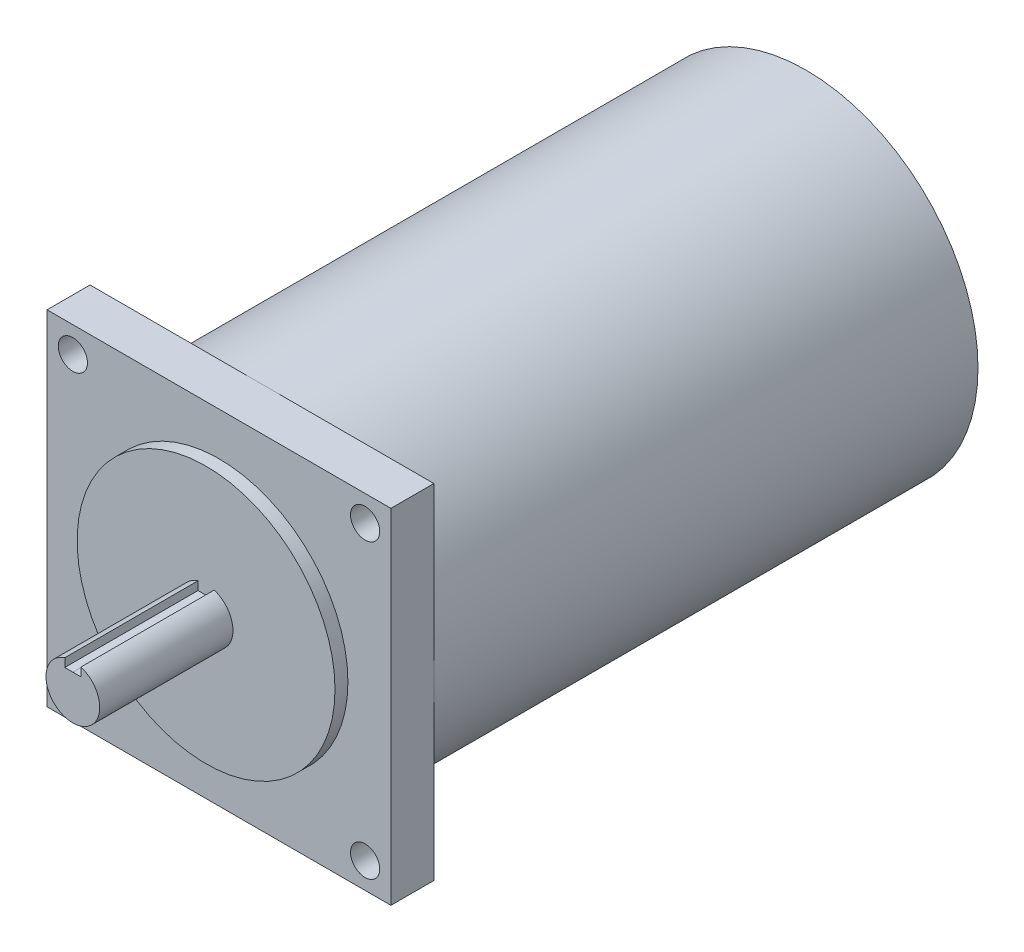
ISO-10303-21;
HEADER;
FILE_DESCRIPTION(('STEP AP214'),'2;1');
FILE_NAME('part.step','',(''),(''),'','','');
FILE_SCHEMA(('AUTOMOTIVE_DESIGN { 1 0 10303 214 1 1 1 1 }'));
ENDSEC;
DATA;
#1=APPLICATION_CONTEXT('core data for automotive mechanical design processes');
#2=APPLICATION_PROTOCOL_DEFINITION('international standard','automotive_design',2000,#1);
#3=PRODUCT_CONTEXT('',#1,'mechanical');
#4=PRODUCT('Part','Part','',(#3));
#5=PRODUCT_RELATED_PRODUCT_CATEGORY('part','',(#4));
#6=PRODUCT_DEFINITION_FORMATION('','',#4);
#7=PRODUCT_DEFINITION_CONTEXT('part definition',#1,'design');
#8=PRODUCT_DEFINITION('design','',#6,#7);
#9=PRODUCT_DEFINITION_SHAPE('','',#8);
#10=(LENGTH_UNIT() NAMED_UNIT(*) SI_UNIT(.MILLI.,.METRE.));
#11=(NAMED_UNIT(*) PLANE_ANGLE_UNIT() SI_UNIT($,.RADIAN.));
#12=(NAMED_UNIT(*) SI_UNIT($,.STERADIAN.) SOLID_ANGLE_UNIT());
#13=UNCERTAINTY_MEASURE_WITH_UNIT(LENGTH_MEASURE(1.E-05),#10,'distance_accuracy_value','');
#14=(GEOMETRIC_REPRESENTATION_CONTEXT(3) GLOBAL_UNCERTAINTY_ASSIGNED_CONTEXT((#13)) GLOBAL_UNIT_ASSIGNED_CONTEXT((#10,
#11,#12)) REPRESENTATION_CONTEXT('',''));
#15=CARTESIAN_POINT('',(0.,0.,0.));
#16=DIRECTION('',(0.,0.,1.));
#17=DIRECTION('',(1.,0.,0.));
#18=AXIS2_PLACEMENT_3D('',#15,#16,#17);
#19=CARTESIAN_POINT('',(0.,0.,0.));
#20=DIRECTION('',(0.,0.,1.));
#21=DIRECTION('',(1.,0.,0.));
#22=AXIS2_PLACEMENT_3D('',#19,#20,#21);
#23=PLANE('',#22);
#24=CARTESIAN_POINT('',(0.,0.,0.));
#25=DIRECTION('',(0.,0.,-1.));
#26=DIRECTION('',(-1.,0.,0.));
#27=AXIS2_PLACEMENT_3D('',#24,#25,#26);
#28=CIRCLE('',#27,50.8);
#29=CARTESIAN_POINT('',(-50.8,0.,0.));
#30=VERTEX_POINT('',#29);
#31=CARTESIAN_POINT('',(0.,50.8,0.));
#32=VERTEX_POINT('',#31);
#33=EDGE_CURVE('E155',#30,#32,#28,.T.);
#34=ORIENTED_EDGE('',*,*,#33,.F.);
#35=DIRECTION('',(0.,-1.,0.));
#36=VECTOR('',#35,1.);
#37=CARTESIAN_POINT('',(-50.8,50.8,0.));
#38=LINE('',#37,#36);
#39=CARTESIAN_POINT('',(-50.8,50.8,0.));
#40=VERTEX_POINT('',#39);
#41=EDGE_CURVE('E137',#40,#30,#38,.T.);
#42=ORIENTED_EDGE('',*,*,#41,.F.);
#43=DIRECTION('',(-1.,0.,0.));
#44=VECTOR('',#43,1.);
#45=CARTESIAN_POINT('',(-50.8,50.8,0.));
#46=LINE('',#45,#44);
#47=EDGE_CURVE('E157',#32,#40,#46,.T.);
#48=ORIENTED_EDGE('',*,*,#47,.F.);
#49=EDGE_LOOP('',(#34,#42,#48));
#50=FACE_BOUND('',#49,.T.);
#51=CARTESIAN_POINT('',(-43.18,43.18,0.));
#52=DIRECTION('',(0.,0.,1.));
#53=DIRECTION('',(1.,0.,0.));
#54=AXIS2_PLACEMENT_3D('',#51,#52,#53);
#55=CIRCLE('',#54,4.318);
#56=CARTESIAN_POINT('',(-38.862,43.18,0.));
#57=VERTEX_POINT('',#56);
#58=EDGE_CURVE('E210',#57,#57,#55,.T.);
#59=ORIENTED_EDGE('',*,*,#58,.T.);
#60=EDGE_LOOP('',(#59));
#61=FACE_BOUND('',#60,.T.);
#62=ADVANCED_FACE('F48',(#50,#61),#23,.F.);
#63=CARTESIAN_POINT('',(50.8,0.,0.));
#64=VERTEX_POINT('',#63);
#65=EDGE_CURVE('E65',#32,#64,#28,.T.);
#66=ORIENTED_EDGE('',*,*,#65,.F.);
#67=CARTESIAN_POINT('',(50.8,50.8,0.));
#68=VERTEX_POINT('',#67);
#69=EDGE_CURVE('E153',#68,#32,#46,.T.);
#70=ORIENTED_EDGE('',*,*,#69,.F.);
#71=DIRECTION('',(0.,1.,0.));
#72=VECTOR('',#71,1.);
#73=CARTESIAN_POINT('',(50.8,50.8,0.));
#74=LINE('',#73,#72);
#75=EDGE_CURVE('E234',#64,#68,#74,.T.);
#76=ORIENTED_EDGE('',*,*,#75,.F.);
#77=EDGE_LOOP('',(#66,#70,#76));
#78=FACE_BOUND('',#77,.T.);
#79=CARTESIAN_POINT('',(43.18,43.18,0.));
#80=DIRECTION('',(0.,0.,1.));
#81=DIRECTION('',(1.,0.,0.));
#82=AXIS2_PLACEMENT_3D('',#79,#80,#81);
#83=CIRCLE('',#82,4.318);
#84=CARTESIAN_POINT('',(47.498,43.18,0.));
#85=VERTEX_POINT('',#84);
#86=EDGE_CURVE('E216',#85,#85,#83,.T.);
#87=ORIENTED_EDGE('',*,*,#86,.T.);
#88=EDGE_LOOP('',(#87));
#89=FACE_BOUND('',#88,.T.);
#90=ADVANCED_FACE('F262',(#78,#89),#23,.F.);
#91=CARTESIAN_POINT('',(0.,-50.8,0.));
#92=VERTEX_POINT('',#91);
#93=EDGE_CURVE('E165',#64,#92,#28,.T.);
#94=ORIENTED_EDGE('',*,*,#93,.F.);
#95=CARTESIAN_POINT('',(50.8,-50.8,0.));
#96=VERTEX_POINT('',#95);
#97=EDGE_CURVE('E247',#96,#64,#74,.T.);
#98=ORIENTED_EDGE('',*,*,#97,.F.);
#99=DIRECTION('',(1.,0.,0.));
#100=VECTOR('',#99,1.);
#101=CARTESIAN_POINT('',(-50.8,-50.8,0.));
#102=LINE('',#101,#100);
#103=EDGE_CURVE('E147',#92,#96,#102,.T.);
#104=ORIENTED_EDGE('',*,*,#103,.F.);
#105=EDGE_LOOP('',(#94,#98,#104));
#106=FACE_BOUND('',#105,.T.);
#107=CARTESIAN_POINT('',(43.18,-43.18,0.));
#108=DIRECTION('',(0.,0.,1.));
#109=DIRECTION('',(1.,0.,0.));
#110=AXIS2_PLACEMENT_3D('',#107,#108,#109);
#111=CIRCLE('',#110,4.318);
#112=CARTESIAN_POINT('',(47.498,-43.18,0.));
#113=VERTEX_POINT('',#112);
#114=EDGE_CURVE('E222',#113,#113,#111,.T.);
#115=ORIENTED_EDGE('',*,*,#114,.T.);
#116=EDGE_LOOP('',(#115));
#117=FACE_BOUND('',#116,.T.);
#118=ADVANCED_FACE('F265',(#106,#117),#23,.F.);
#119=CARTESIAN_POINT('',(0.,0.,55.88));
#120=DIRECTION('',(0.,0.,-1.));
#121=DIRECTION('',(-1.,0.,0.));
#122=AXIS2_PLACEMENT_3D('',#119,#120,#121);
#123=CYLINDRICAL_SURFACE('',#122,7.9375);
#124=DIRECTION('',(0.,0.,-1.));
#125=VECTOR('',#124,1.);
#126=CARTESIAN_POINT('',(2.38760548199157,7.56989077281592,302.564684499768));
#127=LINE('',#126,#125);
#128=CARTESIAN_POINT('',(2.38760548199157,7.56989077281592,55.88));
#129=VERTEX_POINT('',#128);
#130=CARTESIAN_POINT('',(2.38760548199157,7.56989077281592,16.51));
#131=VERTEX_POINT('',#130);
#132=EDGE_CURVE('E198',#129,#131,#127,.T.);
#133=ORIENTED_EDGE('',*,*,#132,.F.);
#134=CARTESIAN_POINT('',(0.,0.,55.88));
#135=DIRECTION('',(0.,0.,1.));
#136=DIRECTION('',(1.,0.,0.));
#137=AXIS2_PLACEMENT_3D('',#134,#135,#136);
#138=CIRCLE('',#137,7.9375);
#139=CARTESIAN_POINT('',(-2.38759451800842,7.56989423093718,55.88));
#140=VERTEX_POINT('',#139);
#141=EDGE_CURVE('E180',#140,#129,#138,.T.);
#142=ORIENTED_EDGE('',*,*,#141,.F.);
#143=DIRECTION('',(0.,0.,-1.));
#144=VECTOR('',#143,1.);
#145=CARTESIAN_POINT('',(-2.38759451800842,7.56989423093718,302.564684499768));
#146=LINE('',#145,#144);
#147=CARTESIAN_POINT('',(-2.38759451800842,7.56989423093718,16.51));
#148=VERTEX_POINT('',#147);
#149=EDGE_CURVE('E189',#140,#148,#146,.T.);
#150=ORIENTED_EDGE('',*,*,#149,.T.);
#151=CARTESIAN_POINT('',(0.,0.,16.51));
#152=DIRECTION('',(0.,0.,1.));
#153=DIRECTION('',(1.,0.,0.));
#154=AXIS2_PLACEMENT_3D('',#151,#152,#153);
#155=CIRCLE('',#154,7.9375);
#156=EDGE_CURVE('E166',#148,#131,#155,.T.);
#157=ORIENTED_EDGE('',*,*,#156,.T.);
#158=EDGE_LOOP('',(#133,#142,#150,#157));
#159=FACE_BOUND('',#158,.T.);
#160=ADVANCED_FACE('F299',(#159),#123,.T.);
#161=CARTESIAN_POINT('',(0.,0.,55.88));
#162=DIRECTION('',(0.,0.,1.));
#163=DIRECTION('',(1.,0.,0.));
#164=AXIS2_PLACEMENT_3D('',#161,#162,#163);
#165=PLANE('',#164);
#166=ORIENTED_EDGE('',*,*,#141,.T.);
#167=DIRECTION('',(0.,1.,0.));
#168=VECTOR('',#167,1.);
#169=CARTESIAN_POINT('',(2.38760548199157,5.06380323093719,55.88));
#170=LINE('',#169,#168);
#171=CARTESIAN_POINT('',(2.38760548199157,5.06380323093719,55.88));
#172=VERTEX_POINT('',#171);
#173=EDGE_CURVE('E176',#172,#129,#170,.T.);
#174=ORIENTED_EDGE('',*,*,#173,.F.);
#175=DIRECTION('',(1.,0.,0.));
#176=VECTOR('',#175,1.);
#177=CARTESIAN_POINT('',(5.48199157596185E-06,5.06380323093719,55.88));
#178=LINE('',#177,#176);
#179=CARTESIAN_POINT('',(5.48199157596185E-06,5.06380323093719,55.88));
#180=VERTEX_POINT('',#179);
#181=EDGE_CURVE('E173',#180,#172,#178,.T.);
#182=ORIENTED_EDGE('',*,*,#181,.F.);
#183=DIRECTION('',(1.,0.,0.));
#184=VECTOR('',#183,1.);
#185=CARTESIAN_POINT('',(5.48199157596185E-06,5.06380323093719,55.88));
#186=LINE('',#185,#184);
#187=CARTESIAN_POINT('',(-2.38759451800842,5.06380323093719,55.88));
#188=VERTEX_POINT('',#187);
#189=EDGE_CURVE('E175',#188,#180,#186,.T.);
#190=ORIENTED_EDGE('',*,*,#189,.F.);
#191=DIRECTION('',(0.,-1.,0.));
#192=VECTOR('',#191,1.);
#193=CARTESIAN_POINT('',(-2.38759451800842,5.06380323093719,55.88));
#194=LINE('',#193,#192);
#195=EDGE_CURVE('E178',#140,#188,#194,.T.);
#196=ORIENTED_EDGE('',*,*,#195,.F.);
#197=EDGE_LOOP('',(#166,#174,#182,#190,#196));
#198=FACE_BOUND('',#197,.T.);
#199=ADVANCED_FACE('F296',(#198),#165,.T.);
#200=CARTESIAN_POINT('',(0.,0.,12.7));
#201=DIRECTION('',(0.,0.,1.));
#202=DIRECTION('',(1.,0.,0.));
#203=AXIS2_PLACEMENT_3D('',#200,#201,#202);
#204=PLANE('',#203);
#205=CARTESIAN_POINT('',(0.,0.,12.7));
#206=DIRECTION('',(0.,0.,1.));
#207=DIRECTION('',(1.,0.,0.));
#208=AXIS2_PLACEMENT_3D('',#205,#206,#207);
#209=CIRCLE('',#208,38.1);
#210=CARTESIAN_POINT('',(38.1,0.,12.7));
#211=VERTEX_POINT('',#210);
#212=EDGE_CURVE('E168',#211,#211,#209,.T.);
#213=ORIENTED_EDGE('',*,*,#212,.F.);
#214=EDGE_LOOP('',(#213));
#215=FACE_BOUND('',#214,.T.);
#216=CARTESIAN_POINT('',(43.18,43.18,12.7));
#217=DIRECTION('',(0.,0.,1.));
#218=DIRECTION('',(1.,0.,0.));
#219=AXIS2_PLACEMENT_3D('',#216,#217,#218);
#220=CIRCLE('',#219,4.318);
#221=CARTESIAN_POINT('',(47.498,43.18,12.7));
#222=VERTEX_POINT('',#221);
#223=EDGE_CURVE('E219',#222,#222,#220,.T.);
#224=ORIENTED_EDGE('',*,*,#223,.F.);
#225=EDGE_LOOP('',(#224));
#226=FACE_BOUND('',#225,.T.);
#227=CARTESIAN_POINT('',(-43.18,-43.18,12.7));
#228=DIRECTION('',(0.,0.,1.));
#229=DIRECTION('',(1.,0.,0.));
#230=AXIS2_PLACEMENT_3D('',#227,#228,#229);
#231=CIRCLE('',#230,4.318);
#232=CARTESIAN_POINT('',(-38.862,-43.18,12.7));
#233=VERTEX_POINT('',#232);
#234=EDGE_CURVE('E231',#233,#233,#231,.T.);
#235=ORIENTED_EDGE('',*,*,#234,.F.);
#236=EDGE_LOOP('',(#235));
#237=FACE_BOUND('',#236,.T.);
#238=DIRECTION('',(0.,1.,0.));
#239=VECTOR('',#238,1.);
#240=CARTESIAN_POINT('',(50.8,50.8,12.7));
#241=LINE('',#240,#239);
#242=CARTESIAN_POINT('',(50.8,-50.8,12.7));
#243=VERTEX_POINT('',#242);
#244=CARTESIAN_POINT('',(50.8,50.8,12.7));
#245=VERTEX_POINT('',#244);
#246=EDGE_CURVE('E237',#243,#245,#241,.T.);
#247=ORIENTED_EDGE('',*,*,#246,.T.);
#248=DIRECTION('',(-1.,0.,0.));
#249=VECTOR('',#248,1.);
#250=CARTESIAN_POINT('',(-50.8,50.8,12.7));
#251=LINE('',#250,#249);
#252=CARTESIAN_POINT('',(-50.8,50.8,12.7));
#253=VERTEX_POINT('',#252);
#254=EDGE_CURVE('E240',#245,#253,#251,.T.);
#255=ORIENTED_EDGE('',*,*,#254,.T.);
#256=DIRECTION('',(0.,-1.,0.));
#257=VECTOR('',#256,1.);
#258=CARTESIAN_POINT('',(-50.8,50.8,12.7));
#259=LINE('',#258,#257);
#260=CARTESIAN_POINT('',(-50.8,-50.8,12.7));
#261=VERTEX_POINT('',#260);
#262=EDGE_CURVE('E242',#253,#261,#259,.T.);
#263=ORIENTED_EDGE('',*,*,#262,.T.);
#264=DIRECTION('',(1.,0.,0.));
#265=VECTOR('',#264,1.);
#266=CARTESIAN_POINT('',(-50.8,-50.8,12.7));
#267=LINE('',#266,#265);
#268=EDGE_CURVE('E244',#261,#243,#267,.T.);
#269=ORIENTED_EDGE('',*,*,#268,.T.);
#270=EDGE_LOOP('',(#247,#255,#263,#269));
#271=FACE_BOUND('',#270,.T.);
#272=CARTESIAN_POINT('',(43.18,-43.18,12.7));
#273=DIRECTION('',(0.,0.,1.));
#274=DIRECTION('',(1.,0.,0.));
#275=AXIS2_PLACEMENT_3D('',#272,#273,#274);
#276=CIRCLE('',#275,4.318);
#277=CARTESIAN_POINT('',(47.498,-43.18,12.7));
#278=VERTEX_POINT('',#277);
#279=EDGE_CURVE('E225',#278,#278,#276,.T.);
#280=ORIENTED_EDGE('',*,*,#279,.F.);
#281=EDGE_LOOP('',(#280));
#282=FACE_BOUND('',#281,.T.);
#283=CARTESIAN_POINT('',(-43.18,43.18,12.7));
#284=DIRECTION('',(0.,0.,1.));
#285=DIRECTION('',(1.,0.,0.));
#286=AXIS2_PLACEMENT_3D('',#283,#284,#285);
#287=CIRCLE('',#286,4.318);
#288=CARTESIAN_POINT('',(-38.862,43.18,12.7));
#289=VERTEX_POINT('',#288);
#290=EDGE_CURVE('E213',#289,#289,#287,.T.);
#291=ORIENTED_EDGE('',*,*,#290,.F.);
#292=EDGE_LOOP('',(#291));
#293=FACE_BOUND('',#292,.T.);
#294=ADVANCED_FACE('F291',(#215,#226,#237,#271,#282,#293),#204,.T.);
#295=EDGE_CURVE('E73',#92,#30,#28,.T.);
#296=ORIENTED_EDGE('',*,*,#295,.F.);
#297=CARTESIAN_POINT('',(-50.8,-50.8,0.));
#298=VERTEX_POINT('',#297);
#299=EDGE_CURVE('E152',#298,#92,#102,.T.);
#300=ORIENTED_EDGE('',*,*,#299,.F.);
#301=EDGE_CURVE('E140',#30,#298,#38,.T.);
#302=ORIENTED_EDGE('',*,*,#301,.F.);
#303=EDGE_LOOP('',(#296,#300,#302));
#304=FACE_BOUND('',#303,.T.);
#305=CARTESIAN_POINT('',(-43.18,-43.18,0.));
#306=DIRECTION('',(0.,0.,1.));
#307=DIRECTION('',(1.,0.,0.));
#308=AXIS2_PLACEMENT_3D('',#305,#306,#307);
#309=CIRCLE('',#308,4.318);
#310=CARTESIAN_POINT('',(-38.862,-43.18,0.));
#311=VERTEX_POINT('',#310);
#312=EDGE_CURVE('E228',#311,#311,#309,.T.);
#313=ORIENTED_EDGE('',*,*,#312,.T.);
#314=EDGE_LOOP('',(#313));
#315=FACE_BOUND('',#314,.T.);
#316=ADVANCED_FACE('F149',(#304,#315),#23,.F.);
#317=CARTESIAN_POINT('',(50.8,50.8,12.7));
#318=DIRECTION('',(-1.,0.,0.));
#319=DIRECTION('',(0.,-1.,0.));
#320=AXIS2_PLACEMENT_3D('',#317,#318,#319);
#321=PLANE('',#320);
#322=ORIENTED_EDGE('',*,*,#97,.T.);
#323=ORIENTED_EDGE('',*,*,#75,.T.);
#324=DIRECTION('',(0.,0.,-1.));
#325=VECTOR('',#324,1.);
#326=CARTESIAN_POINT('',(50.8,50.8,12.7));
#327=LINE('',#326,#325);
#328=EDGE_CURVE('E52',#245,#68,#327,.T.);
#329=ORIENTED_EDGE('',*,*,#328,.F.);
#330=ORIENTED_EDGE('',*,*,#246,.F.);
#331=DIRECTION('',(0.,0.,-1.));
#332=VECTOR('',#331,1.);
#333=CARTESIAN_POINT('',(50.8,-50.8,12.7));
#334=LINE('',#333,#332);
#335=EDGE_CURVE('E246',#243,#96,#334,.T.);
#336=ORIENTED_EDGE('',*,*,#335,.T.);
#337=EDGE_LOOP('',(#322,#323,#329,#330,#336));
#338=FACE_BOUND('',#337,.T.);
#339=ADVANCED_FACE('F50',(#338),#321,.F.);
#340=CARTESIAN_POINT('',(-50.8,50.8,12.7));
#341=DIRECTION('',(0.,-1.,0.));
#342=DIRECTION('',(0.,0.,-1.));
#343=AXIS2_PLACEMENT_3D('',#340,#341,#342);
#344=PLANE('',#343);
#345=ORIENTED_EDGE('',*,*,#69,.T.);
#346=ORIENTED_EDGE('',*,*,#47,.T.);
#347=DIRECTION('',(0.,0.,-1.));
#348=VECTOR('',#347,1.);
#349=CARTESIAN_POINT('',(-50.8,50.8,12.7));
#350=LINE('',#349,#348);
#351=EDGE_CURVE('E144',#253,#40,#350,.T.);
#352=ORIENTED_EDGE('',*,*,#351,.F.);
#353=ORIENTED_EDGE('',*,*,#254,.F.);
#354=ORIENTED_EDGE('',*,*,#328,.T.);
#355=EDGE_LOOP('',(#345,#346,#352,#353,#354));
#356=FACE_BOUND('',#355,.T.);
#357=ADVANCED_FACE('F258',(#356),#344,.F.);
#358=CARTESIAN_POINT('',(-50.8,50.8,12.7));
#359=DIRECTION('',(1.,0.,0.));
#360=DIRECTION('',(0.,1.,0.));
#361=AXIS2_PLACEMENT_3D('',#358,#359,#360);
#362=PLANE('',#361);
#363=ORIENTED_EDGE('',*,*,#41,.T.);
#364=ORIENTED_EDGE('',*,*,#301,.T.);
#365=DIRECTION('',(0.,0.,-1.));
#366=VECTOR('',#365,1.);
#367=CARTESIAN_POINT('',(-50.8,-50.8,12.7));
#368=LINE('',#367,#366);
#369=EDGE_CURVE('E254',#261,#298,#368,.T.);
#370=ORIENTED_EDGE('',*,*,#369,.F.);
#371=ORIENTED_EDGE('',*,*,#262,.F.);
#372=ORIENTED_EDGE('',*,*,#351,.T.);
#373=EDGE_LOOP('',(#363,#364,#370,#371,#372));
#374=FACE_BOUND('',#373,.T.);
#375=ADVANCED_FACE('F138',(#374),#362,.F.);
#376=CARTESIAN_POINT('',(-50.8,-50.8,12.7));
#377=DIRECTION('',(0.,1.,0.));
#378=DIRECTION('',(0.,0.,1.));
#379=AXIS2_PLACEMENT_3D('',#376,#377,#378);
#380=PLANE('',#379);
#381=ORIENTED_EDGE('',*,*,#299,.T.);
#382=ORIENTED_EDGE('',*,*,#103,.T.);
#383=ORIENTED_EDGE('',*,*,#335,.F.);
#384=ORIENTED_EDGE('',*,*,#268,.F.);
#385=ORIENTED_EDGE('',*,*,#369,.T.);
#386=EDGE_LOOP('',(#381,#382,#383,#384,#385));
#387=FACE_BOUND('',#386,.T.);
#388=ADVANCED_FACE('F311',(#387),#380,.F.);
#389=CARTESIAN_POINT('',(-43.18,-43.18,12.7));
#390=DIRECTION('',(0.,0.,-1.));
#391=DIRECTION('',(-1.,0.,0.));
#392=AXIS2_PLACEMENT_3D('',#389,#390,#391);
#393=CYLINDRICAL_SURFACE('',#392,4.318);
#394=ORIENTED_EDGE('',*,*,#234,.T.);
#395=EDGE_LOOP('',(#394));
#396=FACE_BOUND('',#395,.T.);
#397=ORIENTED_EDGE('',*,*,#312,.F.);
#398=EDGE_LOOP('',(#397));
#399=FACE_BOUND('',#398,.T.);
#400=ADVANCED_FACE('F282',(#396,#399),#393,.F.);
#401=CARTESIAN_POINT('',(43.18,-43.18,12.7));
#402=DIRECTION('',(0.,0.,-1.));
#403=DIRECTION('',(-1.,0.,0.));
#404=AXIS2_PLACEMENT_3D('',#401,#402,#403);
#405=CYLINDRICAL_SURFACE('',#404,4.318);
#406=ORIENTED_EDGE('',*,*,#279,.T.);
#407=EDGE_LOOP('',(#406));
#408=FACE_BOUND('',#407,.T.);
#409=ORIENTED_EDGE('',*,*,#114,.F.);
#410=EDGE_LOOP('',(#409));
#411=FACE_BOUND('',#410,.T.);
#412=ADVANCED_FACE('F272',(#408,#411),#405,.F.);
#413=CARTESIAN_POINT('',(43.18,43.18,12.7));
#414=DIRECTION('',(0.,0.,-1.));
#415=DIRECTION('',(-1.,0.,0.));
#416=AXIS2_PLACEMENT_3D('',#413,#414,#415);
#417=CYLINDRICAL_SURFACE('',#416,4.318);
#418=ORIENTED_EDGE('',*,*,#223,.T.);
#419=EDGE_LOOP('',(#418));
#420=FACE_BOUND('',#419,.T.);
#421=ORIENTED_EDGE('',*,*,#86,.F.);
#422=EDGE_LOOP('',(#421));
#423=FACE_BOUND('',#422,.T.);
#424=ADVANCED_FACE('F269',(#420,#423),#417,.F.);
#425=CARTESIAN_POINT('',(-43.18,43.18,12.7));
#426=DIRECTION('',(0.,0.,-1.));
#427=DIRECTION('',(-1.,0.,0.));
#428=AXIS2_PLACEMENT_3D('',#425,#426,#427);
#429=CYLINDRICAL_SURFACE('',#428,4.318);
#430=ORIENTED_EDGE('',*,*,#290,.T.);
#431=EDGE_LOOP('',(#430));
#432=FACE_BOUND('',#431,.T.);
#433=ORIENTED_EDGE('',*,*,#58,.F.);
#434=EDGE_LOOP('',(#433));
#435=FACE_BOUND('',#434,.T.);
#436=ADVANCED_FACE('F271',(#432,#435),#429,.F.);
#437=CARTESIAN_POINT('',(0.,0.,16.51));
#438=DIRECTION('',(0.,0.,-1.));
#439=DIRECTION('',(-1.,0.,0.));
#440=AXIS2_PLACEMENT_3D('',#437,#438,#439);
#441=CYLINDRICAL_SURFACE('',#440,38.1);
#442=CARTESIAN_POINT('',(0.,0.,16.51));
#443=DIRECTION('',(0.,0.,1.));
#444=DIRECTION('',(1.,0.,0.));
#445=AXIS2_PLACEMENT_3D('',#442,#443,#444);
#446=CIRCLE('',#445,38.1);
#447=CARTESIAN_POINT('',(38.1,0.,16.51));
#448=VERTEX_POINT('',#447);
#449=EDGE_CURVE('E206',#448,#448,#446,.T.);
#450=ORIENTED_EDGE('',*,*,#449,.F.);
#451=EDGE_LOOP('',(#450));
#452=FACE_BOUND('',#451,.T.);
#453=ORIENTED_EDGE('',*,*,#212,.T.);
#454=EDGE_LOOP('',(#453));
#455=FACE_BOUND('',#454,.T.);
#456=ADVANCED_FACE('F279',(#452,#455),#441,.T.);
#457=CARTESIAN_POINT('',(0.,0.,16.51));
#458=DIRECTION('',(0.,0.,1.));
#459=DIRECTION('',(1.,0.,0.));
#460=AXIS2_PLACEMENT_3D('',#457,#458,#459);
#461=PLANE('',#460);
#462=ORIENTED_EDGE('',*,*,#156,.F.);
#463=DIRECTION('',(0.,-1.,0.));
#464=VECTOR('',#463,1.);
#465=CARTESIAN_POINT('',(-2.38759451800842,5.06380323093719,16.51));
#466=LINE('',#465,#464);
#467=CARTESIAN_POINT('',(-2.38759451800842,5.06380323093719,16.51));
#468=VERTEX_POINT('',#467);
#469=EDGE_CURVE('E181',#148,#468,#466,.T.);
#470=ORIENTED_EDGE('',*,*,#469,.T.);
#471=DIRECTION('',(1.,0.,0.));
#472=VECTOR('',#471,1.);
#473=CARTESIAN_POINT('',(5.48199157596185E-06,5.06380323093719,16.51));
#474=LINE('',#473,#472);
#475=CARTESIAN_POINT('',(5.48199157596185E-06,5.06380323093719,16.51));
#476=VERTEX_POINT('',#475);
#477=EDGE_CURVE('E183',#468,#476,#474,.T.);
#478=ORIENTED_EDGE('',*,*,#477,.T.);
#479=DIRECTION('',(1.,0.,0.));
#480=VECTOR('',#479,1.);
#481=CARTESIAN_POINT('',(5.48199157596185E-06,5.06380323093719,16.51));
#482=LINE('',#481,#480);
#483=CARTESIAN_POINT('',(2.38760548199157,5.06380323093719,16.51));
#484=VERTEX_POINT('',#483);
#485=EDGE_CURVE('E185',#476,#484,#482,.T.);
#486=ORIENTED_EDGE('',*,*,#485,.T.);
#487=DIRECTION('',(0.,1.,0.));
#488=VECTOR('',#487,1.);
#489=CARTESIAN_POINT('',(2.38760548199157,5.06380323093719,16.51));
#490=LINE('',#489,#488);
#491=EDGE_CURVE('E187',#484,#131,#490,.T.);
#492=ORIENTED_EDGE('',*,*,#491,.T.);
#493=EDGE_LOOP('',(#462,#470,#478,#486,#492));
#494=FACE_BOUND('',#493,.T.);
#495=ORIENTED_EDGE('',*,*,#449,.T.);
#496=EDGE_LOOP('',(#495));
#497=FACE_BOUND('',#496,.T.);
#498=ADVANCED_FACE('F360',(#494,#497),#461,.T.);
#499=CARTESIAN_POINT('',(2.38760548199157,5.06380323093719,302.564684499768));
#500=DIRECTION('',(-1.,0.,0.));
#501=DIRECTION('',(0.,0.,1.));
#502=AXIS2_PLACEMENT_3D('',#499,#500,#501);
#503=PLANE('',#502);
#504=DIRECTION('',(0.,0.,-1.));
#505=VECTOR('',#504,1.);
#506=CARTESIAN_POINT('',(2.38760548199157,5.06380323093719,302.564684499768));
#507=LINE('',#506,#505);
#508=EDGE_CURVE('E201',#172,#484,#507,.T.);
#509=ORIENTED_EDGE('',*,*,#508,.F.);
#510=ORIENTED_EDGE('',*,*,#173,.T.);
#511=ORIENTED_EDGE('',*,*,#132,.T.);
#512=ORIENTED_EDGE('',*,*,#491,.F.);
#513=EDGE_LOOP('',(#509,#510,#511,#512));
#514=FACE_BOUND('',#513,.T.);
#515=ADVANCED_FACE('F369',(#514),#503,.T.);
#516=CARTESIAN_POINT('',(5.48199157596185E-06,5.06380323093719,302.564684499768));
#517=DIRECTION('',(0.,1.,0.));
#518=DIRECTION('',(0.,0.,1.));
#519=AXIS2_PLACEMENT_3D('',#516,#517,#518);
#520=PLANE('',#519);
#521=DIRECTION('',(0.,0.,-1.));
#522=VECTOR('',#521,1.);
#523=CARTESIAN_POINT('',(5.48199157596185E-06,5.06380323093719,302.564684499768));
#524=LINE('',#523,#522);
#525=EDGE_CURVE('E195',#180,#476,#524,.T.);
#526=ORIENTED_EDGE('',*,*,#525,.F.);
#527=ORIENTED_EDGE('',*,*,#181,.T.);
#528=ORIENTED_EDGE('',*,*,#508,.T.);
#529=ORIENTED_EDGE('',*,*,#485,.F.);
#530=EDGE_LOOP('',(#526,#527,#528,#529));
#531=FACE_BOUND('',#530,.T.);
#532=ADVANCED_FACE('F401',(#531),#520,.T.);
#533=CARTESIAN_POINT('',(5.48199157596185E-06,5.06380323093719,302.564684499768));
#534=DIRECTION('',(0.,1.,0.));
#535=DIRECTION('',(0.,0.,1.));
#536=AXIS2_PLACEMENT_3D('',#533,#534,#535);
#537=PLANE('',#536);
#538=DIRECTION('',(0.,0.,-1.));
#539=VECTOR('',#538,1.);
#540=CARTESIAN_POINT('',(-2.38759451800842,5.06380323093719,302.564684499768));
#541=LINE('',#540,#539);
#542=EDGE_CURVE('E192',#188,#468,#541,.T.);
#543=ORIENTED_EDGE('',*,*,#542,.F.);
#544=ORIENTED_EDGE('',*,*,#189,.T.);
#545=ORIENTED_EDGE('',*,*,#525,.T.);
#546=ORIENTED_EDGE('',*,*,#477,.F.);
#547=EDGE_LOOP('',(#543,#544,#545,#546));
#548=FACE_BOUND('',#547,.T.);
#549=ADVANCED_FACE('F397',(#548),#537,.T.);
#550=CARTESIAN_POINT('',(-2.38759451800842,5.06380323093719,302.564684499768));
#551=DIRECTION('',(1.,0.,0.));
#552=DIRECTION('',(0.,0.,-1.));
#553=AXIS2_PLACEMENT_3D('',#550,#551,#552);
#554=PLANE('',#553);
#555=ORIENTED_EDGE('',*,*,#149,.F.);
#556=ORIENTED_EDGE('',*,*,#195,.T.);
#557=ORIENTED_EDGE('',*,*,#542,.T.);
#558=ORIENTED_EDGE('',*,*,#469,.F.);
#559=EDGE_LOOP('',(#555,#556,#557,#558));
#560=FACE_BOUND('',#559,.T.);
#561=ADVANCED_FACE('F394',(#560),#554,.T.);
#562=CARTESIAN_POINT('',(0.,0.,-160.782));
#563=DIRECTION('',(0.,0.,1.));
#564=DIRECTION('',(1.,0.,0.));
#565=AXIS2_PLACEMENT_3D('',#562,#563,#564);
#566=CYLINDRICAL_SURFACE('',#565,50.8);
#567=CARTESIAN_POINT('',(0.,0.,-160.782));
#568=DIRECTION('',(0.,0.,-1.));
#569=DIRECTION('',(-1.,0.,0.));
#570=AXIS2_PLACEMENT_3D('',#567,#568,#569);
#571=CIRCLE('',#570,50.8);
#572=CARTESIAN_POINT('',(-50.8,0.,-160.782));
#573=VERTEX_POINT('',#572);
#574=EDGE_CURVE('E160',#573,#573,#571,.T.);
#575=ORIENTED_EDGE('',*,*,#574,.F.);
#576=EDGE_LOOP('',(#575));
#577=FACE_BOUND('',#576,.T.);
#578=ORIENTED_EDGE('',*,*,#33,.T.);
#579=ORIENTED_EDGE('',*,*,#65,.T.);
#580=ORIENTED_EDGE('',*,*,#93,.T.);
#581=ORIENTED_EDGE('',*,*,#295,.T.);
#582=EDGE_LOOP('',(#578,#579,#580,#581));
#583=FACE_BOUND('',#582,.T.);
#584=ADVANCED_FACE('F164',(#577,#583),#566,.T.);
#585=CARTESIAN_POINT('',(0.,0.,-160.782));
#586=DIRECTION('',(0.,0.,-1.));
#587=DIRECTION('',(-1.,0.,0.));
#588=AXIS2_PLACEMENT_3D('',#585,#586,#587);
#589=PLANE('',#588);
#590=CARTESIAN_POINT('',(0.,0.,-160.782));
#591=DIRECTION('',(0.,0.,-1.));
#592=DIRECTION('',(-1.,0.,0.));
#593=AXIS2_PLACEMENT_3D('',#590,#591,#592);
#594=CIRCLE('',#593,38.1);
#595=CARTESIAN_POINT('',(-38.1,0.,-160.782));
#596=VERTEX_POINT('',#595);
#597=EDGE_CURVE('E57',#596,#596,#594,.T.);
#598=ORIENTED_EDGE('',*,*,#597,.F.);
#599=EDGE_LOOP('',(#598));
#600=FACE_BOUND('',#599,.T.);
#601=ORIENTED_EDGE('',*,*,#574,.T.);
#602=EDGE_LOOP('',(#601));
#603=FACE_BOUND('',#602,.T.);
#604=ADVANCED_FACE('F411',(#600,#603),#589,.T.);
#605=CARTESIAN_POINT('',(0.,0.,-164.592));
#606=DIRECTION('',(0.,0.,1.));
#607=DIRECTION('',(1.,0.,0.));
#608=AXIS2_PLACEMENT_3D('',#605,#606,#607);
#609=CYLINDRICAL_SURFACE('',#608,38.1);
#610=CARTESIAN_POINT('',(0.,0.,-164.592));
#611=DIRECTION('',(0.,0.,-1.));
#612=DIRECTION('',(-1.,0.,0.));
#613=AXIS2_PLACEMENT_3D('',#610,#611,#612);
#614=CIRCLE('',#613,38.1);
#615=CARTESIAN_POINT('',(-38.1,0.,-164.592));
#616=VERTEX_POINT('',#615);
#617=EDGE_CURVE('E161',#616,#616,#614,.T.);
#618=ORIENTED_EDGE('',*,*,#617,.F.);
#619=EDGE_LOOP('',(#618));
#620=FACE_BOUND('',#619,.T.);
#621=ORIENTED_EDGE('',*,*,#597,.T.);
#622=EDGE_LOOP('',(#621));
#623=FACE_BOUND('',#622,.T.);
#624=ADVANCED_FACE('F415',(#620,#623),#609,.T.);
#625=CARTESIAN_POINT('',(0.,0.,-164.592));
#626=DIRECTION('',(0.,0.,-1.));
#627=DIRECTION('',(-1.,0.,0.));
#628=AXIS2_PLACEMENT_3D('',#625,#626,#627);
#629=PLANE('',#628);
#630=CARTESIAN_POINT('',(0.,0.,-164.592));
#631=DIRECTION('',(0.,0.,-1.));
#632=DIRECTION('',(-1.,0.,0.));
#633=AXIS2_PLACEMENT_3D('',#630,#631,#632);
#634=CIRCLE('',#633,6.35);
#635=CARTESIAN_POINT('',(-6.35,0.,-164.592));
#636=VERTEX_POINT('',#635);
#637=EDGE_CURVE('E13',#636,#636,#634,.T.);
#638=ORIENTED_EDGE('',*,*,#637,.F.);
#639=EDGE_LOOP('',(#638));
#640=FACE_BOUND('',#639,.T.);
#641=ORIENTED_EDGE('',*,*,#617,.T.);
#642=EDGE_LOOP('',(#641));
#643=FACE_BOUND('',#642,.T.);
#644=ADVANCED_FACE('F419',(#640,#643),#629,.T.);
#645=CARTESIAN_POINT('',(0.,0.,-182.372));
#646=DIRECTION('',(0.,0.,1.));
#647=DIRECTION('',(1.,0.,0.));
#648=AXIS2_PLACEMENT_3D('',#645,#646,#647);
#649=CYLINDRICAL_SURFACE('',#648,6.35);
#650=CARTESIAN_POINT('',(0.,0.,-182.372));
#651=DIRECTION('',(0.,0.,-1.));
#652=DIRECTION('',(-1.,0.,0.));
#653=AXIS2_PLACEMENT_3D('',#650,#651,#652);
#654=CIRCLE('',#653,6.35);
#655=CARTESIAN_POINT('',(-6.35,0.,-182.372));
#656=VERTEX_POINT('',#655);
#657=EDGE_CURVE('E435',#656,#656,#654,.T.);
#658=ORIENTED_EDGE('',*,*,#657,.F.);
#659=EDGE_LOOP('',(#658));
#660=FACE_BOUND('',#659,.T.);
#661=ORIENTED_EDGE('',*,*,#637,.T.);
#662=EDGE_LOOP('',(#661));
#663=FACE_BOUND('',#662,.T.);
#664=ADVANCED_FACE('F423',(#660,#663),#649,.T.);
#665=CARTESIAN_POINT('',(0.,0.,-182.372));
#666=DIRECTION('',(0.,0.,-1.));
#667=DIRECTION('',(-1.,0.,0.));
#668=AXIS2_PLACEMENT_3D('',#665,#666,#667);
#669=PLANE('',#668);
#670=ORIENTED_EDGE('',*,*,#657,.T.);
#671=EDGE_LOOP('',(#670));
#672=FACE_BOUND('',#671,.T.);
#673=ADVANCED_FACE('F427',(#672),#669,.T.);
#674=CLOSED_SHELL('',(#62,#90,#118,#160,#199,#294,#316,#339,#357,#375,#388,#400,#412,#424,#436,
#456,#498,#515,#532,#549,#561,#584,#604,#624,#644,#664,#673));
#675=MANIFOLD_SOLID_BREP('B2',#674);
#676=ADVANCED_BREP_SHAPE_REPRESENTATION('',(#18,#675),#14);
#677=SHAPE_DEFINITION_REPRESENTATION(#9,#676);
ENDSEC;
END-ISO-10303-21;
